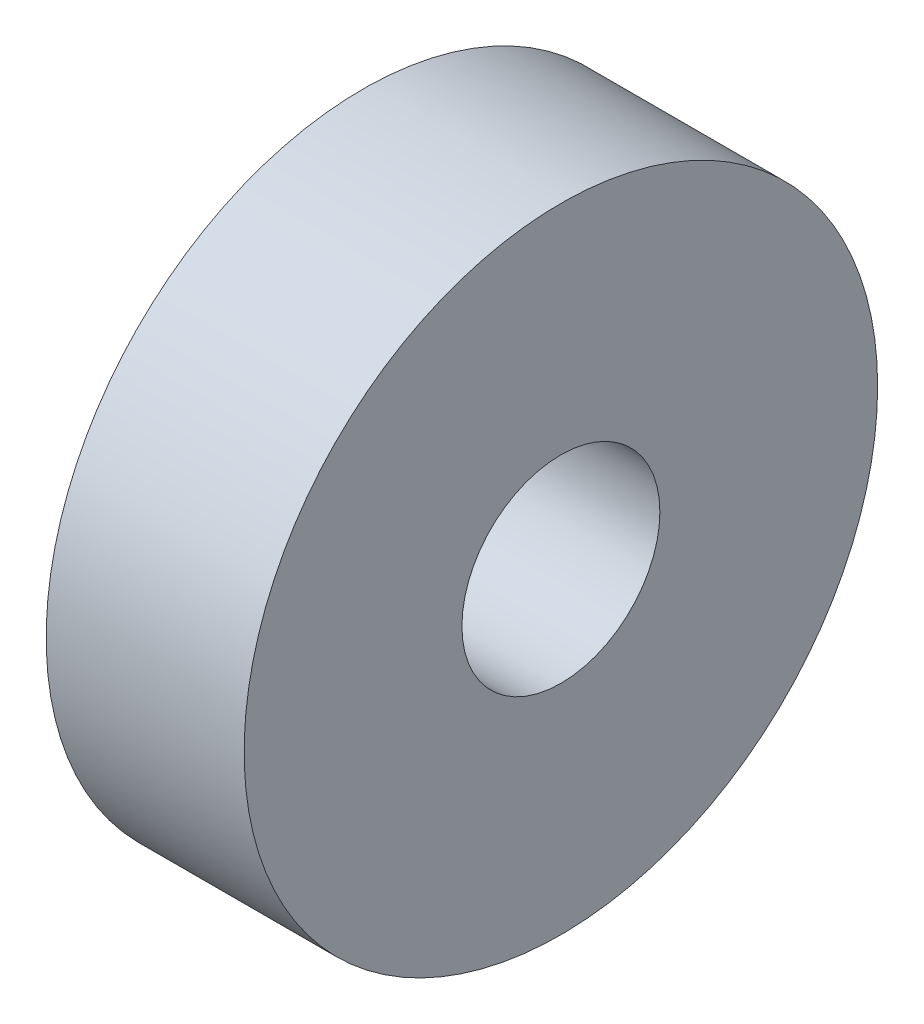
ISO-10303-21;
HEADER;
FILE_DESCRIPTION(('STEP AP214'),'2;1');
FILE_NAME('part.step','',(''),(''),'','','');
FILE_SCHEMA(('AUTOMOTIVE_DESIGN { 1 0 10303 214 1 1 1 1 }'));
ENDSEC;
DATA;
#1=APPLICATION_CONTEXT('core data for automotive mechanical design processes');
#2=APPLICATION_PROTOCOL_DEFINITION('international standard','automotive_design',2000,#1);
#3=PRODUCT_CONTEXT('',#1,'mechanical');
#4=PRODUCT('Part','Part','',(#3));
#5=PRODUCT_RELATED_PRODUCT_CATEGORY('part','',(#4));
#6=PRODUCT_DEFINITION_FORMATION('','',#4);
#7=PRODUCT_DEFINITION_CONTEXT('part definition',#1,'design');
#8=PRODUCT_DEFINITION('design','',#6,#7);
#9=PRODUCT_DEFINITION_SHAPE('','',#8);
#10=(LENGTH_UNIT() NAMED_UNIT(*) SI_UNIT(.MILLI.,.METRE.));
#11=(NAMED_UNIT(*) PLANE_ANGLE_UNIT() SI_UNIT($,.RADIAN.));
#12=(NAMED_UNIT(*) SI_UNIT($,.STERADIAN.) SOLID_ANGLE_UNIT());
#13=UNCERTAINTY_MEASURE_WITH_UNIT(LENGTH_MEASURE(1.E-05),#10,'distance_accuracy_value','');
#14=(GEOMETRIC_REPRESENTATION_CONTEXT(3) GLOBAL_UNCERTAINTY_ASSIGNED_CONTEXT((#13)) GLOBAL_UNIT_ASSIGNED_CONTEXT((#10,
#11,#12)) REPRESENTATION_CONTEXT('',''));
#15=CARTESIAN_POINT('',(0.,0.,0.));
#16=DIRECTION('',(0.,0.,1.));
#17=DIRECTION('',(1.,0.,0.));
#18=AXIS2_PLACEMENT_3D('',#15,#16,#17);
#19=CARTESIAN_POINT('',(5.,0.,0.));
#20=DIRECTION('',(1.,0.,0.));
#21=DIRECTION('',(0.,0.,-1.));
#22=AXIS2_PLACEMENT_3D('',#19,#20,#21);
#23=PLANE('',#22);
#24=CARTESIAN_POINT('',(5.,0.,0.));
#25=DIRECTION('',(1.,0.,0.));
#26=DIRECTION('',(0.,0.,-1.));
#27=AXIS2_PLACEMENT_3D('',#24,#25,#26);
#28=CIRCLE('',#27,8.);
#29=CARTESIAN_POINT('',(5.,0.,-8.));
#30=VERTEX_POINT('',#29);
#31=EDGE_CURVE('E10',#30,#30,#28,.T.);
#32=ORIENTED_EDGE('',*,*,#31,.T.);
#33=EDGE_LOOP('',(#32));
#34=FACE_BOUND('',#33,.T.);
#35=CARTESIAN_POINT('',(5.,0.,0.));
#36=DIRECTION('',(1.,0.,0.));
#37=DIRECTION('',(0.,0.,-1.));
#38=AXIS2_PLACEMENT_3D('',#35,#36,#37);
#39=CIRCLE('',#38,2.5);
#40=CARTESIAN_POINT('',(5.,0.,-2.5));
#41=VERTEX_POINT('',#40);
#42=EDGE_CURVE('E50',#41,#41,#39,.T.);
#43=ORIENTED_EDGE('',*,*,#42,.F.);
#44=EDGE_LOOP('',(#43));
#45=FACE_BOUND('',#44,.T.);
#46=ADVANCED_FACE('F37',(#34,#45),#23,.T.);
#47=CARTESIAN_POINT('',(0.,0.,0.));
#48=DIRECTION('',(1.,0.,0.));
#49=DIRECTION('',(0.,0.,-1.));
#50=AXIS2_PLACEMENT_3D('',#47,#48,#49);
#51=PLANE('',#50);
#52=CARTESIAN_POINT('',(0.,0.,0.));
#53=DIRECTION('',(1.,0.,0.));
#54=DIRECTION('',(0.,0.,-1.));
#55=AXIS2_PLACEMENT_3D('',#52,#53,#54);
#56=CIRCLE('',#55,8.);
#57=CARTESIAN_POINT('',(0.,0.,-8.));
#58=VERTEX_POINT('',#57);
#59=EDGE_CURVE('E41',#58,#58,#56,.T.);
#60=ORIENTED_EDGE('',*,*,#59,.F.);
#61=EDGE_LOOP('',(#60));
#62=FACE_BOUND('',#61,.T.);
#63=CARTESIAN_POINT('',(0.,0.,0.));
#64=DIRECTION('',(1.,0.,0.));
#65=DIRECTION('',(0.,0.,-1.));
#66=AXIS2_PLACEMENT_3D('',#63,#64,#65);
#67=CIRCLE('',#66,2.5);
#68=CARTESIAN_POINT('',(0.,0.,-2.5));
#69=VERTEX_POINT('',#68);
#70=EDGE_CURVE('E52',#69,#69,#67,.T.);
#71=ORIENTED_EDGE('',*,*,#70,.T.);
#72=EDGE_LOOP('',(#71));
#73=FACE_BOUND('',#72,.T.);
#74=ADVANCED_FACE('F64',(#62,#73),#51,.F.);
#75=CARTESIAN_POINT('',(5.,0.,0.));
#76=DIRECTION('',(-1.,0.,0.));
#77=DIRECTION('',(0.,0.,1.));
#78=AXIS2_PLACEMENT_3D('',#75,#76,#77);
#79=CYLINDRICAL_SURFACE('',#78,8.);
#80=ORIENTED_EDGE('',*,*,#31,.F.);
#81=EDGE_LOOP('',(#80));
#82=FACE_BOUND('',#81,.T.);
#83=ORIENTED_EDGE('',*,*,#59,.T.);
#84=EDGE_LOOP('',(#83));
#85=FACE_BOUND('',#84,.T.);
#86=ADVANCED_FACE('F39',(#82,#85),#79,.T.);
#87=CARTESIAN_POINT('',(5.,0.,0.));
#88=DIRECTION('',(-1.,0.,0.));
#89=DIRECTION('',(0.,0.,1.));
#90=AXIS2_PLACEMENT_3D('',#87,#88,#89);
#91=CYLINDRICAL_SURFACE('',#90,2.5);
#92=ORIENTED_EDGE('',*,*,#42,.T.);
#93=EDGE_LOOP('',(#92));
#94=FACE_BOUND('',#93,.T.);
#95=ORIENTED_EDGE('',*,*,#70,.F.);
#96=EDGE_LOOP('',(#95));
#97=FACE_BOUND('',#96,.T.);
#98=ADVANCED_FACE('F60',(#94,#97),#91,.F.);
#99=CLOSED_SHELL('',(#46,#74,#86,#98));
#100=MANIFOLD_SOLID_BREP('B2',#99);
#101=ADVANCED_BREP_SHAPE_REPRESENTATION('',(#18,#100),#14);
#102=SHAPE_DEFINITION_REPRESENTATION(#9,#101);
ENDSEC;
END-ISO-10303-21;
